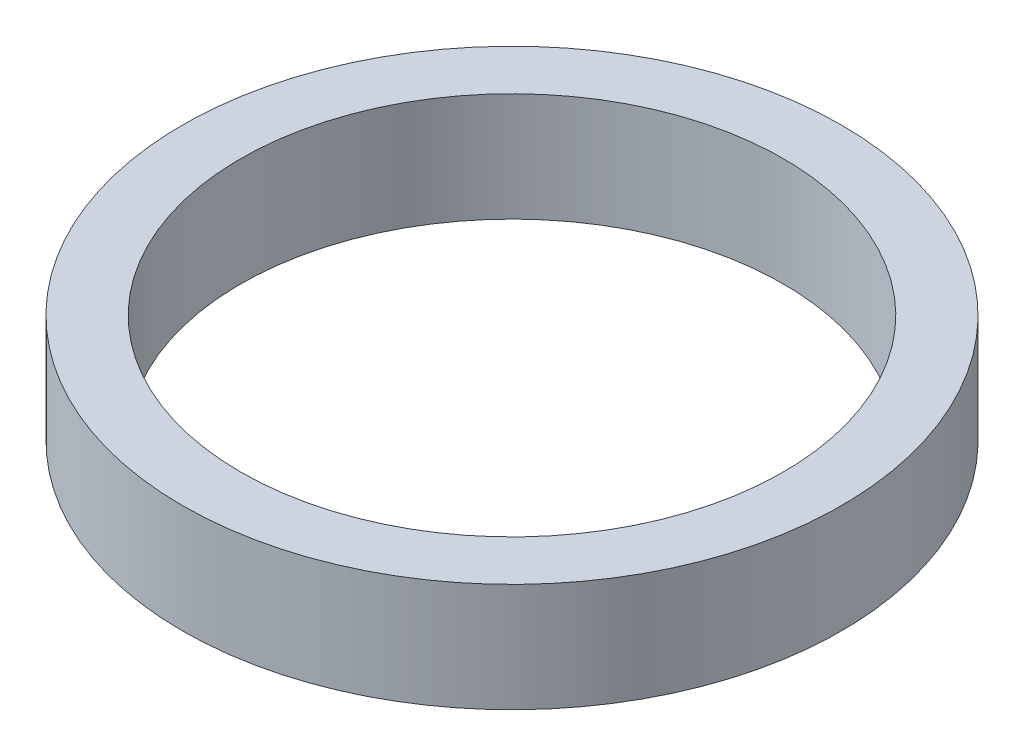
ISO-10303-21;
HEADER;
FILE_DESCRIPTION(('STEP AP214'),'2;1');
FILE_NAME('part.step','',(''),(''),'','','');
FILE_SCHEMA(('AUTOMOTIVE_DESIGN { 1 0 10303 214 1 1 1 1 }'));
ENDSEC;
DATA;
#1=APPLICATION_CONTEXT('core data for automotive mechanical design processes');
#2=APPLICATION_PROTOCOL_DEFINITION('international standard','automotive_design',2000,#1);
#3=PRODUCT_CONTEXT('',#1,'mechanical');
#4=PRODUCT('Part','Part','',(#3));
#5=PRODUCT_RELATED_PRODUCT_CATEGORY('part','',(#4));
#6=PRODUCT_DEFINITION_FORMATION('','',#4);
#7=PRODUCT_DEFINITION_CONTEXT('part definition',#1,'design');
#8=PRODUCT_DEFINITION('design','',#6,#7);
#9=PRODUCT_DEFINITION_SHAPE('','',#8);
#10=(LENGTH_UNIT() NAMED_UNIT(*) SI_UNIT(.MILLI.,.METRE.));
#11=(NAMED_UNIT(*) PLANE_ANGLE_UNIT() SI_UNIT($,.RADIAN.));
#12=(NAMED_UNIT(*) SI_UNIT($,.STERADIAN.) SOLID_ANGLE_UNIT());
#13=UNCERTAINTY_MEASURE_WITH_UNIT(LENGTH_MEASURE(1.E-05),#10,'distance_accuracy_value','');
#14=(GEOMETRIC_REPRESENTATION_CONTEXT(3) GLOBAL_UNCERTAINTY_ASSIGNED_CONTEXT((#13)) GLOBAL_UNIT_ASSIGNED_CONTEXT((#10,
#11,#12)) REPRESENTATION_CONTEXT('',''));
#15=CARTESIAN_POINT('',(0.,0.,0.));
#16=DIRECTION('',(0.,0.,1.));
#17=DIRECTION('',(1.,0.,0.));
#18=AXIS2_PLACEMENT_3D('',#15,#16,#17);
#19=CARTESIAN_POINT('',(0.,14.,0.));
#20=DIRECTION('',(0.,-1.,0.));
#21=DIRECTION('',(0.,0.,-1.));
#22=AXIS2_PLACEMENT_3D('',#19,#20,#21);
#23=CYLINDRICAL_SURFACE('',#22,42.5);
#24=CARTESIAN_POINT('',(0.,14.,0.));
#25=DIRECTION('',(0.,1.,0.));
#26=DIRECTION('',(0.,0.,1.));
#27=AXIS2_PLACEMENT_3D('',#24,#25,#26);
#28=CIRCLE('',#27,42.5);
#29=CARTESIAN_POINT('',(0.,14.,42.5));
#30=VERTEX_POINT('',#29);
#31=EDGE_CURVE('E10',#30,#30,#28,.T.);
#32=ORIENTED_EDGE('',*,*,#31,.F.);
#33=EDGE_LOOP('',(#32));
#34=FACE_BOUND('',#33,.T.);
#35=CARTESIAN_POINT('',(0.,0.,0.));
#36=DIRECTION('',(0.,1.,0.));
#37=DIRECTION('',(0.,0.,1.));
#38=AXIS2_PLACEMENT_3D('',#35,#36,#37);
#39=CIRCLE('',#38,42.5);
#40=CARTESIAN_POINT('',(0.,0.,42.5));
#41=VERTEX_POINT('',#40);
#42=EDGE_CURVE('E37',#41,#41,#39,.T.);
#43=ORIENTED_EDGE('',*,*,#42,.T.);
#44=EDGE_LOOP('',(#43));
#45=FACE_BOUND('',#44,.T.);
#46=ADVANCED_FACE('F40',(#34,#45),#23,.T.);
#47=CARTESIAN_POINT('',(0.,14.,0.));
#48=DIRECTION('',(0.,1.,0.));
#49=DIRECTION('',(0.,0.,1.));
#50=AXIS2_PLACEMENT_3D('',#47,#48,#49);
#51=PLANE('',#50);
#52=CARTESIAN_POINT('',(0.,14.,0.));
#53=DIRECTION('',(0.,1.,0.));
#54=DIRECTION('',(0.,0.,1.));
#55=AXIS2_PLACEMENT_3D('',#52,#53,#54);
#56=CIRCLE('',#55,35.);
#57=CARTESIAN_POINT('',(0.,14.,35.));
#58=VERTEX_POINT('',#57);
#59=EDGE_CURVE('E50',#58,#58,#56,.T.);
#60=ORIENTED_EDGE('',*,*,#59,.F.);
#61=EDGE_LOOP('',(#60));
#62=FACE_BOUND('',#61,.T.);
#63=ORIENTED_EDGE('',*,*,#31,.T.);
#64=EDGE_LOOP('',(#63));
#65=FACE_BOUND('',#64,.T.);
#66=ADVANCED_FACE('F59',(#62,#65),#51,.T.);
#67=CARTESIAN_POINT('',(0.,0.,0.));
#68=DIRECTION('',(0.,1.,0.));
#69=DIRECTION('',(0.,0.,1.));
#70=AXIS2_PLACEMENT_3D('',#67,#68,#69);
#71=PLANE('',#70);
#72=CARTESIAN_POINT('',(0.,0.,0.));
#73=DIRECTION('',(0.,1.,0.));
#74=DIRECTION('',(0.,0.,1.));
#75=AXIS2_PLACEMENT_3D('',#72,#73,#74);
#76=CIRCLE('',#75,35.);
#77=CARTESIAN_POINT('',(0.,0.,35.));
#78=VERTEX_POINT('',#77);
#79=EDGE_CURVE('E47',#78,#78,#76,.T.);
#80=ORIENTED_EDGE('',*,*,#79,.T.);
#81=EDGE_LOOP('',(#80));
#82=FACE_BOUND('',#81,.T.);
#83=ORIENTED_EDGE('',*,*,#42,.F.);
#84=EDGE_LOOP('',(#83));
#85=FACE_BOUND('',#84,.T.);
#86=ADVANCED_FACE('F58',(#82,#85),#71,.F.);
#87=CARTESIAN_POINT('',(0.,14.,0.));
#88=DIRECTION('',(0.,-1.,0.));
#89=DIRECTION('',(0.,0.,-1.));
#90=AXIS2_PLACEMENT_3D('',#87,#88,#89);
#91=CYLINDRICAL_SURFACE('',#90,35.);
#92=ORIENTED_EDGE('',*,*,#59,.T.);
#93=EDGE_LOOP('',(#92));
#94=FACE_BOUND('',#93,.T.);
#95=ORIENTED_EDGE('',*,*,#79,.F.);
#96=EDGE_LOOP('',(#95));
#97=FACE_BOUND('',#96,.T.);
#98=ADVANCED_FACE('F54',(#94,#97),#91,.F.);
#99=CLOSED_SHELL('',(#46,#66,#86,#98));
#100=MANIFOLD_SOLID_BREP('B2',#99);
#101=ADVANCED_BREP_SHAPE_REPRESENTATION('',(#18,#100),#14);
#102=SHAPE_DEFINITION_REPRESENTATION(#9,#101);
ENDSEC;
END-ISO-10303-21;
